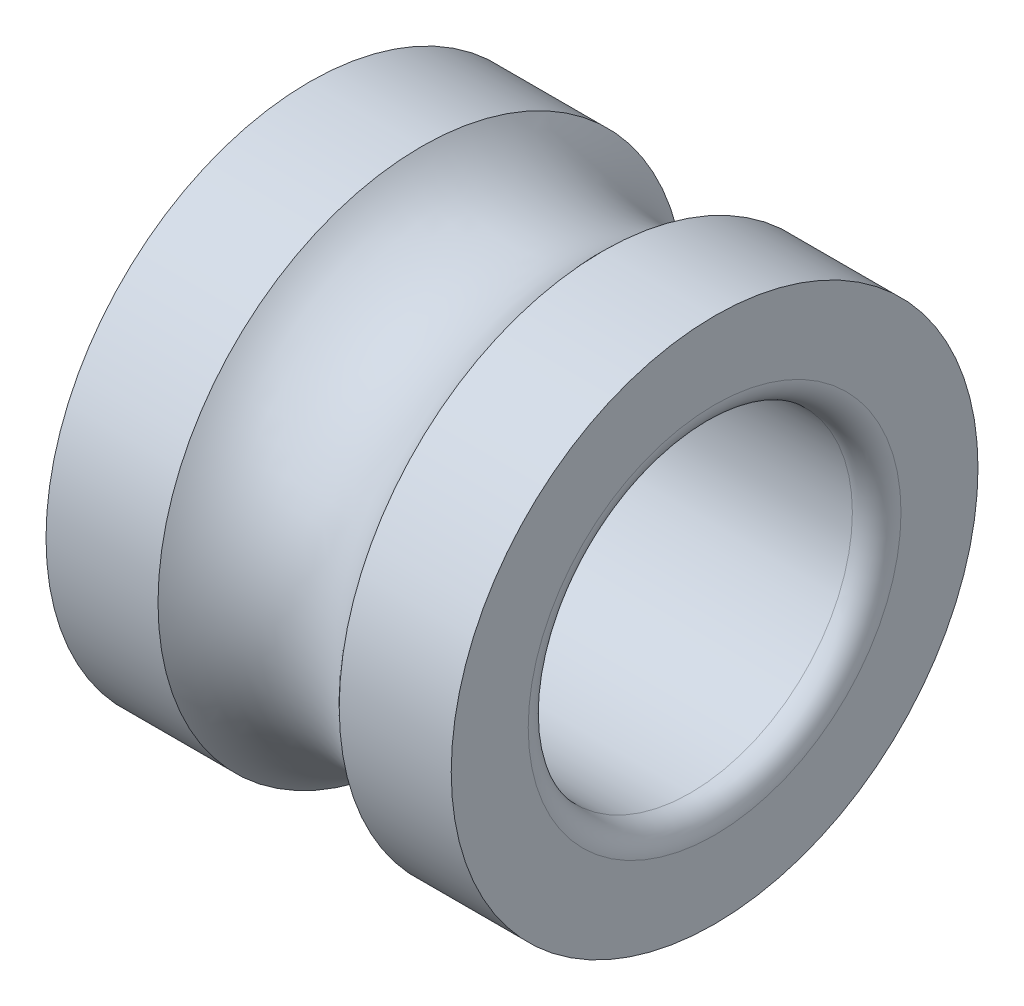
ISO-10303-21;
HEADER;
FILE_DESCRIPTION(('STEP AP214'),'2;1');
FILE_NAME('part.step','',(''),(''),'','','');
FILE_SCHEMA(('AUTOMOTIVE_DESIGN { 1 0 10303 214 1 1 1 1 }'));
ENDSEC;
DATA;
#1=APPLICATION_CONTEXT('core data for automotive mechanical design processes');
#2=APPLICATION_PROTOCOL_DEFINITION('international standard','automotive_design',2000,#1);
#3=PRODUCT_CONTEXT('',#1,'mechanical');
#4=PRODUCT('Part','Part','',(#3));
#5=PRODUCT_RELATED_PRODUCT_CATEGORY('part','',(#4));
#6=PRODUCT_DEFINITION_FORMATION('','',#4);
#7=PRODUCT_DEFINITION_CONTEXT('part definition',#1,'design');
#8=PRODUCT_DEFINITION('design','',#6,#7);
#9=PRODUCT_DEFINITION_SHAPE('','',#8);
#10=(LENGTH_UNIT() NAMED_UNIT(*) SI_UNIT(.MILLI.,.METRE.));
#11=(NAMED_UNIT(*) PLANE_ANGLE_UNIT() SI_UNIT($,.RADIAN.));
#12=(NAMED_UNIT(*) SI_UNIT($,.STERADIAN.) SOLID_ANGLE_UNIT());
#13=UNCERTAINTY_MEASURE_WITH_UNIT(LENGTH_MEASURE(1.E-05),#10,'distance_accuracy_value','');
#14=(GEOMETRIC_REPRESENTATION_CONTEXT(3) GLOBAL_UNCERTAINTY_ASSIGNED_CONTEXT((#13)) GLOBAL_UNIT_ASSIGNED_CONTEXT((#10,
#11,#12)) REPRESENTATION_CONTEXT('',''));
#15=CARTESIAN_POINT('',(0.,0.,0.));
#16=DIRECTION('',(0.,0.,1.));
#17=DIRECTION('',(1.,0.,0.));
#18=AXIS2_PLACEMENT_3D('',#15,#16,#17);
#19=CARTESIAN_POINT('',(2.5,0.,0.));
#20=DIRECTION('',(-1.,0.,0.));
#21=DIRECTION('',(0.,0.,1.));
#22=AXIS2_PLACEMENT_3D('',#19,#20,#21);
#23=TOROIDAL_SURFACE('',#22,4.25,1.5);
#24=CARTESIAN_POINT('',(1.38196601125011,0.,0.));
#25=DIRECTION('',(-1.,0.,0.));
#26=DIRECTION('',(0.,0.,1.));
#27=AXIS2_PLACEMENT_3D('',#24,#25,#26);
#28=CIRCLE('',#27,3.25);
#29=CARTESIAN_POINT('',(1.38196601125011,0.,3.25));
#30=VERTEX_POINT('',#29);
#31=EDGE_CURVE('E48',#30,#30,#28,.T.);
#32=ORIENTED_EDGE('',*,*,#31,.F.);
#33=EDGE_LOOP('',(#32));
#34=FACE_BOUND('',#33,.T.);
#35=CARTESIAN_POINT('',(3.61803398874989,0.,0.));
#36=DIRECTION('',(-1.,0.,0.));
#37=DIRECTION('',(0.,0.,1.));
#38=AXIS2_PLACEMENT_3D('',#35,#36,#37);
#39=CIRCLE('',#38,3.25);
#40=CARTESIAN_POINT('',(3.61803398874989,0.,3.25));
#41=VERTEX_POINT('',#40);
#42=EDGE_CURVE('E57',#41,#41,#39,.T.);
#43=ORIENTED_EDGE('',*,*,#42,.T.);
#44=EDGE_LOOP('',(#43));
#45=FACE_BOUND('',#44,.T.);
#46=ADVANCED_FACE('F29',(#34,#45),#23,.F.);
#47=CARTESIAN_POINT('',(0.,0.,0.));
#48=DIRECTION('',(-1.,0.,0.));
#49=DIRECTION('',(0.,0.,1.));
#50=AXIS2_PLACEMENT_3D('',#47,#48,#49);
#51=CYLINDRICAL_SURFACE('',#50,3.25);
#52=CARTESIAN_POINT('',(0.,0.,0.));
#53=DIRECTION('',(-1.,0.,0.));
#54=DIRECTION('',(0.,0.,1.));
#55=AXIS2_PLACEMENT_3D('',#52,#53,#54);
#56=CIRCLE('',#55,3.25);
#57=CARTESIAN_POINT('',(0.,0.,3.25));
#58=VERTEX_POINT('',#57);
#59=EDGE_CURVE('E51',#58,#58,#56,.T.);
#60=ORIENTED_EDGE('',*,*,#59,.F.);
#61=EDGE_LOOP('',(#60));
#62=FACE_BOUND('',#61,.T.);
#63=ORIENTED_EDGE('',*,*,#31,.T.);
#64=EDGE_LOOP('',(#63));
#65=FACE_BOUND('',#64,.T.);
#66=ADVANCED_FACE('F80',(#62,#65),#51,.T.);
#67=CARTESIAN_POINT('',(0.,2.,0.));
#68=DIRECTION('',(1.,0.,0.));
#69=DIRECTION('',(0.,0.,-1.));
#70=AXIS2_PLACEMENT_3D('',#67,#68,#69);
#71=PLANE('',#70);
#72=CARTESIAN_POINT('',(0.,0.,0.));
#73=DIRECTION('',(1.,0.,0.));
#74=DIRECTION('',(0.,0.,-1.));
#75=AXIS2_PLACEMENT_3D('',#72,#73,#74);
#76=CIRCLE('',#75,2.3);
#77=CARTESIAN_POINT('',(0.,0.,-2.3));
#78=VERTEX_POINT('',#77);
#79=EDGE_CURVE('E35',#78,#78,#76,.T.);
#80=ORIENTED_EDGE('',*,*,#79,.T.);
#81=EDGE_LOOP('',(#80));
#82=FACE_BOUND('',#81,.T.);
#83=ORIENTED_EDGE('',*,*,#59,.T.);
#84=EDGE_LOOP('',(#83));
#85=FACE_BOUND('',#84,.T.);
#86=ADVANCED_FACE('F76',(#82,#85),#71,.F.);
#87=CARTESIAN_POINT('',(0.,0.,0.));
#88=DIRECTION('',(-1.,0.,0.));
#89=DIRECTION('',(0.,0.,1.));
#90=AXIS2_PLACEMENT_3D('',#87,#88,#89);
#91=CYLINDRICAL_SURFACE('',#90,2.);
#92=CARTESIAN_POINT('',(0.3,0.,0.));
#93=DIRECTION('',(1.,0.,0.));
#94=DIRECTION('',(0.,0.,-1.));
#95=AXIS2_PLACEMENT_3D('',#92,#93,#94);
#96=CIRCLE('',#95,2.);
#97=CARTESIAN_POINT('',(0.3,0.,-2.));
#98=VERTEX_POINT('',#97);
#99=EDGE_CURVE('E39',#98,#98,#96,.F.);
#100=ORIENTED_EDGE('',*,*,#99,.T.);
#101=EDGE_LOOP('',(#100));
#102=FACE_BOUND('',#101,.T.);
#103=CARTESIAN_POINT('',(4.7,0.,0.));
#104=DIRECTION('',(-1.,0.,0.));
#105=DIRECTION('',(0.,0.,1.));
#106=AXIS2_PLACEMENT_3D('',#103,#104,#105);
#107=CIRCLE('',#106,2.);
#108=CARTESIAN_POINT('',(4.7,0.,2.));
#109=VERTEX_POINT('',#108);
#110=EDGE_CURVE('E43',#109,#109,#107,.F.);
#111=ORIENTED_EDGE('',*,*,#110,.T.);
#112=EDGE_LOOP('',(#111));
#113=FACE_BOUND('',#112,.T.);
#114=ADVANCED_FACE('F71',(#102,#113),#91,.F.);
#115=CARTESIAN_POINT('',(5.,2.,0.));
#116=DIRECTION('',(-1.,0.,0.));
#117=DIRECTION('',(0.,0.,1.));
#118=AXIS2_PLACEMENT_3D('',#115,#116,#117);
#119=PLANE('',#118);
#120=CARTESIAN_POINT('',(5.,0.,0.));
#121=DIRECTION('',(-1.,0.,0.));
#122=DIRECTION('',(0.,0.,1.));
#123=AXIS2_PLACEMENT_3D('',#120,#121,#122);
#124=CIRCLE('',#123,2.3);
#125=CARTESIAN_POINT('',(5.,0.,2.3));
#126=VERTEX_POINT('',#125);
#127=EDGE_CURVE('E10',#126,#126,#124,.T.);
#128=ORIENTED_EDGE('',*,*,#127,.T.);
#129=EDGE_LOOP('',(#128));
#130=FACE_BOUND('',#129,.T.);
#131=CARTESIAN_POINT('',(5.,0.,0.));
#132=DIRECTION('',(-1.,0.,0.));
#133=DIRECTION('',(0.,0.,1.));
#134=AXIS2_PLACEMENT_3D('',#131,#132,#133);
#135=CIRCLE('',#134,3.25);
#136=CARTESIAN_POINT('',(5.,0.,3.25));
#137=VERTEX_POINT('',#136);
#138=EDGE_CURVE('E54',#137,#137,#135,.T.);
#139=ORIENTED_EDGE('',*,*,#138,.F.);
#140=EDGE_LOOP('',(#139));
#141=FACE_BOUND('',#140,.T.);
#142=ADVANCED_FACE('F66',(#130,#141),#119,.F.);
#143=CARTESIAN_POINT('',(0.,0.,0.));
#144=DIRECTION('',(-1.,0.,0.));
#145=DIRECTION('',(0.,0.,1.));
#146=AXIS2_PLACEMENT_3D('',#143,#144,#145);
#147=CYLINDRICAL_SURFACE('',#146,3.25);
#148=ORIENTED_EDGE('',*,*,#42,.F.);
#149=EDGE_LOOP('',(#148));
#150=FACE_BOUND('',#149,.T.);
#151=ORIENTED_EDGE('',*,*,#138,.T.);
#152=EDGE_LOOP('',(#151));
#153=FACE_BOUND('',#152,.T.);
#154=ADVANCED_FACE('F62',(#150,#153),#147,.T.);
#155=CARTESIAN_POINT('',(0.3,0.,0.));
#156=DIRECTION('',(1.,0.,0.));
#157=DIRECTION('',(0.,0.,-1.));
#158=AXIS2_PLACEMENT_3D('',#155,#156,#157);
#159=TOROIDAL_SURFACE('',#158,2.3,0.3);
#160=ORIENTED_EDGE('',*,*,#79,.F.);
#161=EDGE_LOOP('',(#160));
#162=FACE_BOUND('',#161,.T.);
#163=ORIENTED_EDGE('',*,*,#99,.F.);
#164=EDGE_LOOP('',(#163));
#165=FACE_BOUND('',#164,.T.);
#166=ADVANCED_FACE('F65',(#162,#165),#159,.T.);
#167=CARTESIAN_POINT('',(4.7,0.,0.));
#168=DIRECTION('',(-1.,0.,0.));
#169=DIRECTION('',(0.,0.,1.));
#170=AXIS2_PLACEMENT_3D('',#167,#168,#169);
#171=TOROIDAL_SURFACE('',#170,2.3,0.3);
#172=ORIENTED_EDGE('',*,*,#110,.F.);
#173=EDGE_LOOP('',(#172));
#174=FACE_BOUND('',#173,.T.);
#175=ORIENTED_EDGE('',*,*,#127,.F.);
#176=EDGE_LOOP('',(#175));
#177=FACE_BOUND('',#176,.T.);
#178=ADVANCED_FACE('F119',(#174,#177),#171,.T.);
#179=CLOSED_SHELL('',(#46,#66,#86,#114,#142,#154,#166,#178));
#180=MANIFOLD_SOLID_BREP('B2',#179);
#181=ADVANCED_BREP_SHAPE_REPRESENTATION('',(#18,#180),#14);
#182=SHAPE_DEFINITION_REPRESENTATION(#9,#181);
ENDSEC;
END-ISO-10303-21;
